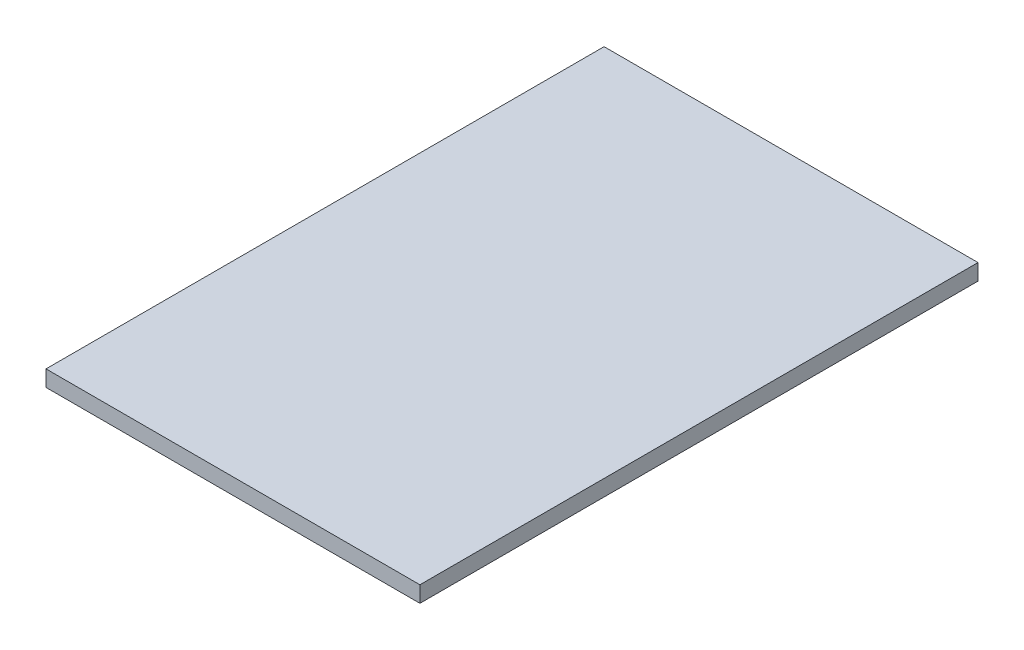
ISO-10303-21;
HEADER;
FILE_DESCRIPTION(('STEP AP214'),'2;1');
FILE_NAME('part.step','',(''),(''),'','','');
FILE_SCHEMA(('AUTOMOTIVE_DESIGN { 1 0 10303 214 1 1 1 1 }'));
ENDSEC;
DATA;
#1=APPLICATION_CONTEXT('core data for automotive mechanical design processes');
#2=APPLICATION_PROTOCOL_DEFINITION('international standard','automotive_design',2000,#1);
#3=PRODUCT_CONTEXT('',#1,'mechanical');
#4=PRODUCT('Part','Part','',(#3));
#5=PRODUCT_RELATED_PRODUCT_CATEGORY('part','',(#4));
#6=PRODUCT_DEFINITION_FORMATION('','',#4);
#7=PRODUCT_DEFINITION_CONTEXT('part definition',#1,'design');
#8=PRODUCT_DEFINITION('design','',#6,#7);
#9=PRODUCT_DEFINITION_SHAPE('','',#8);
#10=(LENGTH_UNIT() NAMED_UNIT(*) SI_UNIT(.MILLI.,.METRE.));
#11=(NAMED_UNIT(*) PLANE_ANGLE_UNIT() SI_UNIT($,.RADIAN.));
#12=(NAMED_UNIT(*) SI_UNIT($,.STERADIAN.) SOLID_ANGLE_UNIT());
#13=UNCERTAINTY_MEASURE_WITH_UNIT(LENGTH_MEASURE(1.E-05),#10,'distance_accuracy_value','');
#14=(GEOMETRIC_REPRESENTATION_CONTEXT(3) GLOBAL_UNCERTAINTY_ASSIGNED_CONTEXT((#13)) GLOBAL_UNIT_ASSIGNED_CONTEXT((#10,
#11,#12)) REPRESENTATION_CONTEXT('',''));
#15=CARTESIAN_POINT('',(0.,0.,0.));
#16=DIRECTION('',(0.,0.,1.));
#17=DIRECTION('',(1.,0.,0.));
#18=AXIS2_PLACEMENT_3D('',#15,#16,#17);
#19=CARTESIAN_POINT('',(-70.1707106781186,-2.79999999999999,60.));
#20=DIRECTION('',(1.,0.,0.));
#21=DIRECTION('',(0.,0.,-1.));
#22=AXIS2_PLACEMENT_3D('',#19,#20,#21);
#23=PLANE('',#22);
#24=DIRECTION('',(0.,-1.,0.));
#25=VECTOR('',#24,1.);
#26=CARTESIAN_POINT('',(-70.1707106781186,-2.79999999999999,0.));
#27=LINE('',#26,#25);
#28=CARTESIAN_POINT('',(-70.1707106781186,-1.06976027466911,0.));
#29=VERTEX_POINT('',#28);
#30=CARTESIAN_POINT('',(-70.1707106781186,-2.79999999999999,0.));
#31=VERTEX_POINT('',#30);
#32=EDGE_CURVE('E96',#29,#31,#27,.T.);
#33=ORIENTED_EDGE('',*,*,#32,.T.);
#34=DIRECTION('',(0.,0.,-1.));
#35=VECTOR('',#34,1.);
#36=CARTESIAN_POINT('',(-70.1707106781186,-2.79999999999999,60.));
#37=LINE('',#36,#35);
#38=CARTESIAN_POINT('',(-70.1707106781186,-2.79999999999999,60.));
#39=VERTEX_POINT('',#38);
#40=EDGE_CURVE('E11',#39,#31,#37,.T.);
#41=ORIENTED_EDGE('',*,*,#40,.F.);
#42=DIRECTION('',(0.,-1.,0.));
#43=VECTOR('',#42,1.);
#44=CARTESIAN_POINT('',(-70.1707106781186,-2.79999999999999,60.));
#45=LINE('',#44,#43);
#46=CARTESIAN_POINT('',(-70.1707106781186,-1.06976027466911,60.));
#47=VERTEX_POINT('',#46);
#48=EDGE_CURVE('E84',#47,#39,#45,.T.);
#49=ORIENTED_EDGE('',*,*,#48,.F.);
#50=DIRECTION('',(0.,0.,-1.));
#51=VECTOR('',#50,1.);
#52=CARTESIAN_POINT('',(-70.1707106781186,-1.06976027466911,60.));
#53=LINE('',#52,#51);
#54=EDGE_CURVE('E92',#47,#29,#53,.T.);
#55=ORIENTED_EDGE('',*,*,#54,.T.);
#56=EDGE_LOOP('',(#33,#41,#49,#55));
#57=FACE_BOUND('',#56,.T.);
#58=ADVANCED_FACE('F33',(#57),#23,.F.);
#59=CARTESIAN_POINT('',(-70.1707106781186,-2.79999999999999,60.));
#60=DIRECTION('',(0.,1.,0.));
#61=DIRECTION('',(0.,0.,1.));
#62=AXIS2_PLACEMENT_3D('',#59,#60,#61);
#63=PLANE('',#62);
#64=DIRECTION('',(1.,0.,0.));
#65=VECTOR('',#64,1.);
#66=CARTESIAN_POINT('',(-70.1707106781186,-2.79999999999999,0.));
#67=LINE('',#66,#65);
#68=CARTESIAN_POINT('',(-29.9707106781187,-2.79999999999999,0.));
#69=VERTEX_POINT('',#68);
#70=EDGE_CURVE('E88',#31,#69,#67,.T.);
#71=ORIENTED_EDGE('',*,*,#70,.T.);
#72=DIRECTION('',(0.,0.,-1.));
#73=VECTOR('',#72,1.);
#74=CARTESIAN_POINT('',(-29.9707106781187,-2.79999999999999,60.));
#75=LINE('',#74,#73);
#76=CARTESIAN_POINT('',(-29.9707106781187,-2.79999999999999,60.));
#77=VERTEX_POINT('',#76);
#78=EDGE_CURVE('E41',#77,#69,#75,.T.);
#79=ORIENTED_EDGE('',*,*,#78,.F.);
#80=DIRECTION('',(1.,0.,0.));
#81=VECTOR('',#80,1.);
#82=CARTESIAN_POINT('',(-70.1707106781186,-2.79999999999999,60.));
#83=LINE('',#82,#81);
#84=EDGE_CURVE('E79',#39,#77,#83,.T.);
#85=ORIENTED_EDGE('',*,*,#84,.F.);
#86=ORIENTED_EDGE('',*,*,#40,.T.);
#87=EDGE_LOOP('',(#71,#79,#85,#86));
#88=FACE_BOUND('',#87,.T.);
#89=ADVANCED_FACE('F87',(#88),#63,.F.);
#90=CARTESIAN_POINT('',(-29.9707106781187,-2.79999999999999,60.));
#91=DIRECTION('',(-1.,0.,0.));
#92=DIRECTION('',(0.,0.,1.));
#93=AXIS2_PLACEMENT_3D('',#90,#91,#92);
#94=PLANE('',#93);
#95=DIRECTION('',(0.,1.,0.));
#96=VECTOR('',#95,1.);
#97=CARTESIAN_POINT('',(-29.9707106781187,-2.79999999999999,0.));
#98=LINE('',#97,#96);
#99=CARTESIAN_POINT('',(-29.9707106781187,-1.06976027466911,0.));
#100=VERTEX_POINT('',#99);
#101=EDGE_CURVE('E66',#69,#100,#98,.T.);
#102=ORIENTED_EDGE('',*,*,#101,.T.);
#103=DIRECTION('',(0.,0.,-1.));
#104=VECTOR('',#103,1.);
#105=CARTESIAN_POINT('',(-29.9707106781187,-1.06976027466911,60.));
#106=LINE('',#105,#104);
#107=CARTESIAN_POINT('',(-29.9707106781187,-1.06976027466911,60.));
#108=VERTEX_POINT('',#107);
#109=EDGE_CURVE('E89',#108,#100,#106,.T.);
#110=ORIENTED_EDGE('',*,*,#109,.F.);
#111=DIRECTION('',(0.,1.,0.));
#112=VECTOR('',#111,1.);
#113=CARTESIAN_POINT('',(-29.9707106781187,-2.79999999999999,60.));
#114=LINE('',#113,#112);
#115=EDGE_CURVE('E82',#77,#108,#114,.T.);
#116=ORIENTED_EDGE('',*,*,#115,.F.);
#117=ORIENTED_EDGE('',*,*,#78,.T.);
#118=EDGE_LOOP('',(#102,#110,#116,#117));
#119=FACE_BOUND('',#118,.T.);
#120=ADVANCED_FACE('F90',(#119),#94,.F.);
#121=CARTESIAN_POINT('',(-70.1707106781186,-1.06976027466911,60.));
#122=DIRECTION('',(0.,-1.,0.));
#123=DIRECTION('',(0.,0.,-1.));
#124=AXIS2_PLACEMENT_3D('',#121,#122,#123);
#125=PLANE('',#124);
#126=DIRECTION('',(-1.,0.,0.));
#127=VECTOR('',#126,1.);
#128=CARTESIAN_POINT('',(-70.1707106781186,-1.06976027466911,0.));
#129=LINE('',#128,#127);
#130=EDGE_CURVE('E72',#100,#29,#129,.T.);
#131=ORIENTED_EDGE('',*,*,#130,.T.);
#132=ORIENTED_EDGE('',*,*,#54,.F.);
#133=DIRECTION('',(-1.,0.,0.));
#134=VECTOR('',#133,1.);
#135=CARTESIAN_POINT('',(-70.1707106781186,-1.06976027466911,60.));
#136=LINE('',#135,#134);
#137=EDGE_CURVE('E49',#108,#47,#136,.T.);
#138=ORIENTED_EDGE('',*,*,#137,.F.);
#139=ORIENTED_EDGE('',*,*,#109,.T.);
#140=EDGE_LOOP('',(#131,#132,#138,#139));
#141=FACE_BOUND('',#140,.T.);
#142=ADVANCED_FACE('F103',(#141),#125,.F.);
#143=CARTESIAN_POINT('',(0.,0.,60.));
#144=DIRECTION('',(0.,0.,-1.));
#145=DIRECTION('',(-1.,0.,0.));
#146=AXIS2_PLACEMENT_3D('',#143,#144,#145);
#147=PLANE('',#146);
#148=ORIENTED_EDGE('',*,*,#48,.T.);
#149=ORIENTED_EDGE('',*,*,#84,.T.);
#150=ORIENTED_EDGE('',*,*,#115,.T.);
#151=ORIENTED_EDGE('',*,*,#137,.T.);
#152=EDGE_LOOP('',(#148,#149,#150,#151));
#153=FACE_BOUND('',#152,.T.);
#154=ADVANCED_FACE('F80',(#153),#147,.F.);
#155=CARTESIAN_POINT('',(0.,0.,0.));
#156=DIRECTION('',(0.,0.,-1.));
#157=DIRECTION('',(-1.,0.,0.));
#158=AXIS2_PLACEMENT_3D('',#155,#156,#157);
#159=PLANE('',#158);
#160=ORIENTED_EDGE('',*,*,#32,.F.);
#161=ORIENTED_EDGE('',*,*,#130,.F.);
#162=ORIENTED_EDGE('',*,*,#101,.F.);
#163=ORIENTED_EDGE('',*,*,#70,.F.);
#164=EDGE_LOOP('',(#160,#161,#162,#163));
#165=FACE_BOUND('',#164,.T.);
#166=ADVANCED_FACE('F106',(#165),#159,.T.);
#167=CLOSED_SHELL('',(#58,#89,#120,#142,#154,#166));
#168=MANIFOLD_SOLID_BREP('B2',#167);
#169=ADVANCED_BREP_SHAPE_REPRESENTATION('',(#18,#168),#14);
#170=SHAPE_DEFINITION_REPRESENTATION(#9,#169);
ENDSEC;
END-ISO-10303-21;
